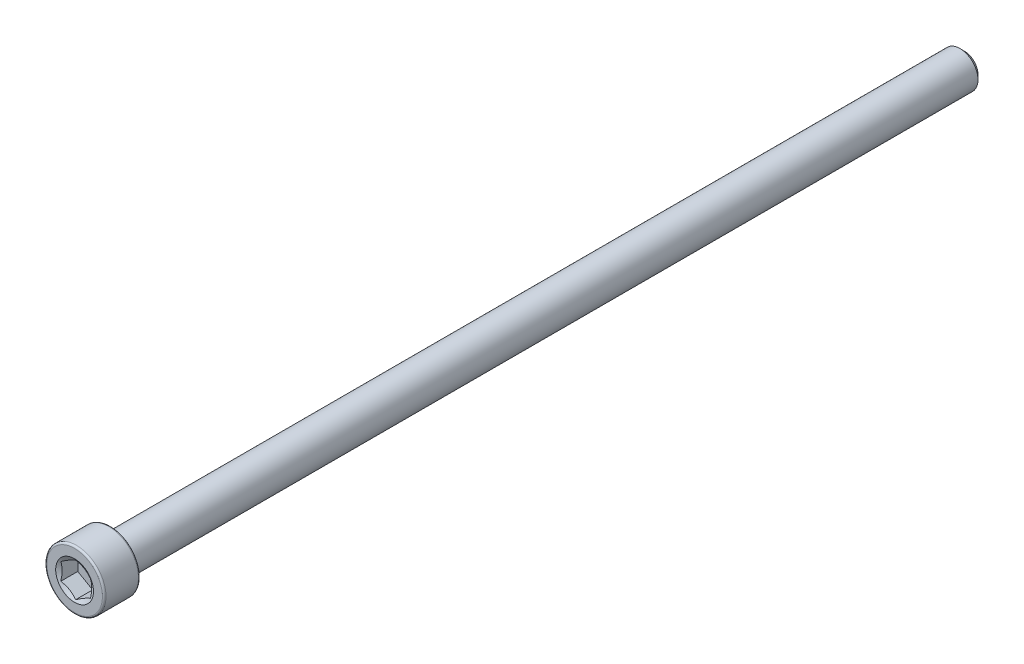
ISO-10303-21;
HEADER;
FILE_DESCRIPTION(('STEP AP214'),'2;1');
FILE_NAME('part.step','',(''),(''),'','','');
FILE_SCHEMA(('AUTOMOTIVE_DESIGN { 1 0 10303 214 1 1 1 1 }'));
ENDSEC;
DATA;
#1=APPLICATION_CONTEXT('core data for automotive mechanical design processes');
#2=APPLICATION_PROTOCOL_DEFINITION('international standard','automotive_design',2000,#1);
#3=PRODUCT_CONTEXT('',#1,'mechanical');
#4=PRODUCT('Part','Part','',(#3));
#5=PRODUCT_RELATED_PRODUCT_CATEGORY('part','',(#4));
#6=PRODUCT_DEFINITION_FORMATION('','',#4);
#7=PRODUCT_DEFINITION_CONTEXT('part definition',#1,'design');
#8=PRODUCT_DEFINITION('design','',#6,#7);
#9=PRODUCT_DEFINITION_SHAPE('','',#8);
#10=(LENGTH_UNIT() NAMED_UNIT(*) SI_UNIT(.MILLI.,.METRE.));
#11=(NAMED_UNIT(*) PLANE_ANGLE_UNIT() SI_UNIT($,.RADIAN.));
#12=(NAMED_UNIT(*) SI_UNIT($,.STERADIAN.) SOLID_ANGLE_UNIT());
#13=UNCERTAINTY_MEASURE_WITH_UNIT(LENGTH_MEASURE(1.E-05),#10,'distance_accuracy_value','');
#14=(GEOMETRIC_REPRESENTATION_CONTEXT(3) GLOBAL_UNCERTAINTY_ASSIGNED_CONTEXT((#13)) GLOBAL_UNIT_ASSIGNED_CONTEXT((#10,
#11,#12)) REPRESENTATION_CONTEXT('',''));
#15=CARTESIAN_POINT('',(0.,0.,0.));
#16=DIRECTION('',(0.,0.,1.));
#17=DIRECTION('',(1.,0.,0.));
#18=AXIS2_PLACEMENT_3D('',#15,#16,#17);
#19=CARTESIAN_POINT('',(0.,0.,-59.563));
#20=DIRECTION('',(0.,0.,-1.));
#21=DIRECTION('',(-1.,0.,0.));
#22=AXIS2_PLACEMENT_3D('',#19,#20,#21);
#23=PLANE('',#22);
#24=CARTESIAN_POINT('',(0.,0.,-59.563));
#25=DIRECTION('',(0.,0.,-1.));
#26=DIRECTION('',(-1.,0.,0.));
#27=AXIS2_PLACEMENT_3D('',#24,#25,#26);
#28=CIRCLE('',#27,1.81768750000003);
#29=CARTESIAN_POINT('',(-1.81768750000003,0.,-59.563));
#30=VERTEX_POINT('',#29);
#31=EDGE_CURVE('E52',#30,#30,#28,.T.);
#32=ORIENTED_EDGE('',*,*,#31,.T.);
#33=EDGE_LOOP('',(#32));
#34=FACE_BOUND('',#33,.T.);
#35=ADVANCED_FACE('F39',(#34),#23,.T.);
#36=CARTESIAN_POINT('',(0.,0.,-59.563));
#37=DIRECTION('',(0.,0.,1.));
#38=DIRECTION('',(1.,0.,0.));
#39=AXIS2_PLACEMENT_3D('',#36,#37,#38);
#40=CONICAL_SURFACE('',#39,1.81768750000003,0.785398163397443);
#41=CARTESIAN_POINT('',(0.,0.,-58.9676875));
#42=DIRECTION('',(0.,0.,-1.));
#43=DIRECTION('',(-1.,0.,0.));
#44=AXIS2_PLACEMENT_3D('',#41,#42,#43);
#45=CIRCLE('',#44,2.41300000000003);
#46=CARTESIAN_POINT('',(-2.41300000000003,0.,-58.9676875));
#47=VERTEX_POINT('',#46);
#48=EDGE_CURVE('E137',#47,#47,#45,.T.);
#49=ORIENTED_EDGE('',*,*,#48,.T.);
#50=EDGE_LOOP('',(#49));
#51=FACE_BOUND('',#50,.T.);
#52=ORIENTED_EDGE('',*,*,#31,.F.);
#53=EDGE_LOOP('',(#52));
#54=FACE_BOUND('',#53,.T.);
#55=ADVANCED_FACE('F143',(#51,#54),#40,.T.);
#56=CARTESIAN_POINT('',(0.,0.,-59.563));
#57=DIRECTION('',(0.,0.,-1.));
#58=DIRECTION('',(-1.,0.,0.));
#59=AXIS2_PLACEMENT_3D('',#56,#57,#58);
#60=CYLINDRICAL_SURFACE('',#59,2.41300000000002);
#61=CARTESIAN_POINT('',(0.,0.,54.737));
#62=DIRECTION('',(0.,0.,-1.));
#63=DIRECTION('',(-1.,0.,0.));
#64=AXIS2_PLACEMENT_3D('',#61,#62,#63);
#65=CIRCLE('',#64,2.41300000000001);
#66=CARTESIAN_POINT('',(-2.41300000000001,0.,54.737));
#67=VERTEX_POINT('',#66);
#68=EDGE_CURVE('E134',#67,#67,#65,.T.);
#69=ORIENTED_EDGE('',*,*,#68,.T.);
#70=EDGE_LOOP('',(#69));
#71=FACE_BOUND('',#70,.T.);
#72=ORIENTED_EDGE('',*,*,#48,.F.);
#73=EDGE_LOOP('',(#72));
#74=FACE_BOUND('',#73,.T.);
#75=ADVANCED_FACE('F145',(#71,#74),#60,.T.);
#76=CARTESIAN_POINT('',(0.,2.413,54.737));
#77=DIRECTION('',(0.,0.,-1.));
#78=DIRECTION('',(-1.,0.,0.));
#79=AXIS2_PLACEMENT_3D('',#76,#77,#78);
#80=PLANE('',#79);
#81=CARTESIAN_POINT('',(0.,0.,54.737));
#82=DIRECTION('',(0.,0.,-1.));
#83=DIRECTION('',(-1.,0.,0.));
#84=AXIS2_PLACEMENT_3D('',#81,#82,#83);
#85=CIRCLE('',#84,3.72745);
#86=CARTESIAN_POINT('',(-3.72745,0.,54.737));
#87=VERTEX_POINT('',#86);
#88=EDGE_CURVE('E131',#87,#87,#85,.T.);
#89=ORIENTED_EDGE('',*,*,#88,.T.);
#90=EDGE_LOOP('',(#89));
#91=FACE_BOUND('',#90,.T.);
#92=ORIENTED_EDGE('',*,*,#68,.F.);
#93=EDGE_LOOP('',(#92));
#94=FACE_BOUND('',#93,.T.);
#95=ADVANCED_FACE('F151',(#91,#94),#80,.T.);
#96=CARTESIAN_POINT('',(0.,0.,54.9783));
#97=DIRECTION('',(0.,0.,-1.));
#98=DIRECTION('',(-1.,0.,0.));
#99=AXIS2_PLACEMENT_3D('',#96,#97,#98);
#100=TOROIDAL_SURFACE('',#99,3.72745,0.241299999999999);
#101=CARTESIAN_POINT('',(0.,0.,54.9783));
#102=DIRECTION('',(0.,0.,-1.));
#103=DIRECTION('',(-1.,0.,0.));
#104=AXIS2_PLACEMENT_3D('',#101,#102,#103);
#105=CIRCLE('',#104,3.96875);
#106=CARTESIAN_POINT('',(-3.96875,0.,54.9783));
#107=VERTEX_POINT('',#106);
#108=EDGE_CURVE('E128',#107,#107,#105,.T.);
#109=ORIENTED_EDGE('',*,*,#108,.T.);
#110=EDGE_LOOP('',(#109));
#111=FACE_BOUND('',#110,.T.);
#112=ORIENTED_EDGE('',*,*,#88,.F.);
#113=EDGE_LOOP('',(#112));
#114=FACE_BOUND('',#113,.T.);
#115=ADVANCED_FACE('F157',(#111,#114),#100,.T.);
#116=CARTESIAN_POINT('',(0.,0.,-59.563));
#117=DIRECTION('',(0.,0.,-1.));
#118=DIRECTION('',(-1.,0.,0.));
#119=AXIS2_PLACEMENT_3D('',#116,#117,#118);
#120=CYLINDRICAL_SURFACE('',#119,3.96875);
#121=CARTESIAN_POINT('',(0.,0.,59.3217));
#122=DIRECTION('',(0.,0.,-1.));
#123=DIRECTION('',(-1.,0.,0.));
#124=AXIS2_PLACEMENT_3D('',#121,#122,#123);
#125=CIRCLE('',#124,3.96875);
#126=CARTESIAN_POINT('',(-3.96875,0.,59.3217));
#127=VERTEX_POINT('',#126);
#128=EDGE_CURVE('E125',#127,#127,#125,.T.);
#129=ORIENTED_EDGE('',*,*,#128,.T.);
#130=EDGE_LOOP('',(#129));
#131=FACE_BOUND('',#130,.T.);
#132=ORIENTED_EDGE('',*,*,#108,.F.);
#133=EDGE_LOOP('',(#132));
#134=FACE_BOUND('',#133,.T.);
#135=ADVANCED_FACE('F161',(#131,#134),#120,.T.);
#136=CARTESIAN_POINT('',(0.,0.,59.3217));
#137=DIRECTION('',(0.,0.,-1.));
#138=DIRECTION('',(-1.,0.,0.));
#139=AXIS2_PLACEMENT_3D('',#136,#137,#138);
#140=TOROIDAL_SURFACE('',#139,3.72745,0.2413);
#141=CARTESIAN_POINT('',(0.,0.,59.563));
#142=DIRECTION('',(0.,0.,-1.));
#143=DIRECTION('',(-1.,0.,0.));
#144=AXIS2_PLACEMENT_3D('',#141,#142,#143);
#145=CIRCLE('',#144,3.72745);
#146=CARTESIAN_POINT('',(-3.72745,0.,59.563));
#147=VERTEX_POINT('',#146);
#148=EDGE_CURVE('E122',#147,#147,#145,.T.);
#149=ORIENTED_EDGE('',*,*,#148,.T.);
#150=EDGE_LOOP('',(#149));
#151=FACE_BOUND('',#150,.T.);
#152=ORIENTED_EDGE('',*,*,#128,.F.);
#153=EDGE_LOOP('',(#152));
#154=FACE_BOUND('',#153,.T.);
#155=ADVANCED_FACE('F165',(#151,#154),#140,.T.);
#156=CARTESIAN_POINT('',(0.,3.72744999999998,59.563));
#157=DIRECTION('',(0.,0.,1.));
#158=DIRECTION('',(1.,0.,0.));
#159=AXIS2_PLACEMENT_3D('',#156,#157,#158);
#160=PLANE('',#159);
#161=CARTESIAN_POINT('',(0.,0.,59.563));
#162=DIRECTION('',(0.,0.,1.));
#163=DIRECTION('',(1.,0.,0.));
#164=AXIS2_PLACEMENT_3D('',#161,#162,#163);
#165=CIRCLE('',#164,2.53070740070525);
#166=CARTESIAN_POINT('',(2.53070740070525,0.,59.563));
#167=VERTEX_POINT('',#166);
#168=EDGE_CURVE('E259',#167,#167,#165,.T.);
#169=ORIENTED_EDGE('',*,*,#168,.F.);
#170=EDGE_LOOP('',(#169));
#171=FACE_BOUND('',#170,.T.);
#172=ORIENTED_EDGE('',*,*,#148,.F.);
#173=EDGE_LOOP('',(#172));
#174=FACE_BOUND('',#173,.T.);
#175=ADVANCED_FACE('F169',(#171,#174),#160,.T.);
#176=CARTESIAN_POINT('',(0.,0.,59.563));
#177=DIRECTION('',(0.,0.,1.));
#178=DIRECTION('',(1.,0.,0.));
#179=AXIS2_PLACEMENT_3D('',#176,#177,#178);
#180=CONICAL_SURFACE('',#179,2.53070740070525,1.0471975511966);
#181=ORIENTED_EDGE('',*,*,#168,.T.);
#182=EDGE_LOOP('',(#181));
#183=FACE_BOUND('',#182,.T.);
#184=CARTESIAN_POINT('',(1.98457499999998,1.14556397036931,59.4248787393351));
#185=CARTESIAN_POINT('',(1.89737036121931,1.19591159204392,59.3957977498695));
#186=CARTESIAN_POINT('',(1.80941298069499,1.24669380936685,59.3693492756564));
#187=CARTESIAN_POINT('',(1.63197502132767,1.34913766297203,59.3231823388358));
#188=CARTESIAN_POINT('',(1.54249128874367,1.4008011200675,59.3034802098783));
#189=CARTESIAN_POINT('',(1.36463285198752,1.50348773640631,59.2728097995608));
#190=CARTESIAN_POINT('',(1.2762855196939,1.55449509248821,59.2616374103495));
#191=CARTESIAN_POINT('',(1.09917497188904,1.65674991493967,59.2482978636837));
#192=CARTESIAN_POINT('',(1.01041240048945,1.70799700943119,59.2461196620894));
#193=CARTESIAN_POINT('',(0.844542697135332,1.80376192731309,59.2506416191377));
#194=CARTESIAN_POINT('',(0.767410784334087,1.848294057932,59.2562314810852));
#195=CARTESIAN_POINT('',(0.613649492810914,1.93706818098385,59.2739510015263));
#196=CARTESIAN_POINT('',(0.537020646254471,1.9813098661709,59.2860867179588));
#197=CARTESIAN_POINT('',(0.382942111493213,2.07026714969166,59.3164262264737));
#198=CARTESIAN_POINT('',(0.305511932787314,2.11497148421091,59.3347586769203));
#199=CARTESIAN_POINT('',(0.151806688756409,2.20371324822801,59.3763665740295));
#200=CARTESIAN_POINT('',(0.0755296529470657,2.24775181538552,59.3996322389117));
#201=CARTESIAN_POINT('',(-0.000200000000002008,2.29147435090015,59.4248787393351));
#202=B_SPLINE_CURVE_WITH_KNOTS('',3,(#184,#185,#186,#187,#188,#189,#190,#191,#192,#193,#194,
#195,#196,#197,#198,#199,#200,#201),.UNSPECIFIED.,.F.,.F.,(4,2,2,2,2,2,2,2,4),(0.,
0.314555137114082,0.6298665496688,0.937373439505925,1.24450262309397,1.51196650590477,
1.77967834211413,2.05332989762153,2.32644383656791),.UNSPECIFIED.);
#203=CARTESIAN_POINT('',(1.98437499999998,1.14567944042315,59.4248120676293));
#204=VERTEX_POINT('',#203);
#205=CARTESIAN_POINT('',(0.,2.29135888084631,59.4248120676293));
#206=VERTEX_POINT('',#205);
#207=EDGE_CURVE('E106',#204,#206,#202,.T.);
#208=ORIENTED_EDGE('',*,*,#207,.F.);
#209=CARTESIAN_POINT('',(1.98437499999998,-3.00026729742339,60.1786996764954));
#210=CARTESIAN_POINT('',(1.98437499999998,-2.91417852714617,60.1372554995199));
#211=CARTESIAN_POINT('',(1.98437499999998,-2.82788354366182,60.0962318701391));
#212=CARTESIAN_POINT('',(1.98437499999998,-2.65477109089712,60.0152640719882));
#213=CARTESIAN_POINT('',(1.98437499999998,-2.56795353399494,59.9753200907809));
#214=CARTESIAN_POINT('',(1.98437499999998,-2.39320060303682,59.8965322756389));
#215=CARTESIAN_POINT('',(1.98437499999998,-2.30526165499614,59.8576963397322));
#216=CARTESIAN_POINT('',(1.98437499999998,-2.12865626167958,59.7817217534969));
#217=CARTESIAN_POINT('',(1.98437499999998,-2.0399898536152,59.7445830169827));
#218=CARTESIAN_POINT('',(1.98437499999998,-1.85931319770472,59.6714519444036));
#219=CARTESIAN_POINT('',(1.98437499999998,-1.76727839255488,59.6355199296325));
#220=CARTESIAN_POINT('',(1.98437499999998,-1.58210416266519,59.5665670586381));
#221=CARTESIAN_POINT('',(1.98437499999998,-1.48896461158262,59.5335465390977));
#222=CARTESIAN_POINT('',(1.98437499999998,-1.30163731722862,59.4713414082388));
#223=CARTESIAN_POINT('',(1.98437499999998,-1.20745247053434,59.442148166413));
#224=CARTESIAN_POINT('',(1.98437499999998,-1.0177273513406,59.3885801299636));
#225=CARTESIAN_POINT('',(1.98437499999998,-0.922187418803863,59.3642041489301));
#226=CARTESIAN_POINT('',(1.98437499999998,-0.730187774437195,59.3216100252547));
#227=CARTESIAN_POINT('',(1.98437499999998,-0.633734462555379,59.3033635885809));
#228=CARTESIAN_POINT('',(1.98437499999998,-0.439715276353551,59.2741213033277));
#229=CARTESIAN_POINT('',(1.98437499999998,-0.342149489314399,59.263124889865));
#230=CARTESIAN_POINT('',(1.98437499999998,-0.147628044199056,59.2494070417718));
#231=CARTESIAN_POINT('',(1.98437499999998,-0.0506796597421236,59.2465854104354));
#232=CARTESIAN_POINT('',(1.98437499999998,0.143103115571662,59.249185514727));
#233=CARTESIAN_POINT('',(1.98437499999998,0.239937499827362,59.2546077062766));
#234=CARTESIAN_POINT('',(1.98437499999998,0.476970423936255,59.2774923549886));
#235=CARTESIAN_POINT('',(1.98437499999998,0.616748292390843,59.2993270404436));
#236=CARTESIAN_POINT('',(1.98437499999998,0.893607928884514,59.3561402077941));
#237=CARTESIAN_POINT('',(1.98437499999998,1.030686768829,59.3911322170173));
#238=CARTESIAN_POINT('',(1.98437499999998,1.30511969999723,59.4714152230234));
#239=CARTESIAN_POINT('',(1.98437499999998,1.44240893450286,59.5169226619543));
#240=CARTESIAN_POINT('',(1.98437499999998,1.64644508842433,59.5902634246735));
#241=CARTESIAN_POINT('',(1.98437499999998,1.71413212999321,59.6155533074583));
#242=CARTESIAN_POINT('',(1.98437499999998,1.84895802350132,59.6675549515399));
#243=CARTESIAN_POINT('',(1.98437499999998,1.91609688529705,59.6942666872059));
#244=CARTESIAN_POINT('',(1.98437499999998,2.09043183263474,59.7654120267758));
#245=CARTESIAN_POINT('',(1.98437499999998,2.19724734382523,59.8107757687467));
#246=CARTESIAN_POINT('',(1.98437499999998,2.40988153193629,59.9037895460846));
#247=CARTESIAN_POINT('',(1.98437499999998,2.5157001286056,59.9514397636623));
#248=CARTESIAN_POINT('',(1.98437499999998,2.72655852247189,60.0485005052356));
#249=CARTESIAN_POINT('',(1.98437499999998,2.83159810540153,60.0979114933103));
#250=CARTESIAN_POINT('',(1.98437499999998,3.04102680140025,60.1980954913632));
#251=CARTESIAN_POINT('',(1.98437499999998,3.14541589892037,60.2488685337466));
#252=CARTESIAN_POINT('',(1.98437499999998,3.45805934392728,60.4029112385608));
#253=CARTESIAN_POINT('',(1.98437499999998,3.66552471194403,60.5077805102459));
#254=CARTESIAN_POINT('',(1.98437499999998,4.07900502507438,60.7202421528608));
#255=CARTESIAN_POINT('',(1.98437499999998,4.28502019488323,60.8278340895145));
#256=CARTESIAN_POINT('',(1.98437499999998,4.67597606585553,61.0342945522279));
#257=CARTESIAN_POINT('',(1.98437499999998,4.8610092056076,61.1329883192138));
#258=CARTESIAN_POINT('',(1.98437499999998,5.23047989061983,61.331503421698));
#259=CARTESIAN_POINT('',(1.98437499999998,5.41491740749765,61.4313248099387));
#260=CARTESIAN_POINT('',(1.98437499999998,5.78283314119706,61.6315376967861));
#261=CARTESIAN_POINT('',(1.98437499999998,5.96631260293179,61.7319269102676));
#262=CARTESIAN_POINT('',(1.98437499999998,6.33289930192253,61.9333559236772));
#263=CARTESIAN_POINT('',(1.98437499999998,6.51600656168198,62.0343956826348));
#264=CARTESIAN_POINT('',(1.98437499999998,6.69898126466817,62.1356733706002));
#265=B_SPLINE_CURVE_WITH_KNOTS('',3,(#209,#210,#211,#212,#213,#214,#215,#216,#217,#218,#219,
#220,#221,#222,#223,#224,#225,#226,#227,#228,#229,#230,#231,#232,#233,#234,#235,#236,#237,#238,
#239,#240,#241,#242,#243,#244,#245,#246,#247,#248,#249,#250,#251,#252,#253,#254,#255,#256,#257,
#258,#259,#260,#261,#262,#263,#264),.UNSPECIFIED.,.F.,.F.,(4,2,2,2,2,2,2,2,2,2,2,2,2,2,2,2,2,2,
2,2,2,2,2,2,2,2,2,4),(0.,0.286639682230862,0.573328845206275,0.861712521680992,1.1500815374161,
1.44644465754249,1.74284200403622,2.03855903673007,2.33420314830459,2.62846318470744,
2.92270029122631,3.21331540991077,3.50394660154195,3.92748841830869,4.35146688350433,
4.78510306957838,5.00186448248398,5.21862198930867,5.56673163285502,5.91486906368416,
6.26309894038445,6.61133710935788,7.30869129939498,8.0059349511209,8.63505562775265,
9.2642058532201,9.8916471044579,10.5190492194133),.UNSPECIFIED.);
#266=CARTESIAN_POINT('',(1.98437499999998,-1.14567944042315,59.4248120676293));
#267=VERTEX_POINT('',#266);
#268=EDGE_CURVE('E215',#267,#204,#265,.T.);
#269=ORIENTED_EDGE('',*,*,#268,.F.);
#270=CARTESIAN_POINT('',(-0.000200000000001244,-2.29147435090015,59.4248787393351));
#271=CARTESIAN_POINT('',(0.0870046387806751,-2.24112672922554,59.3957977498695));
#272=CARTESIAN_POINT('',(0.174962019304995,-2.19034451190261,59.3693492756564));
#273=CARTESIAN_POINT('',(0.352399978672317,-2.08790065829743,59.3231823388358));
#274=CARTESIAN_POINT('',(0.441883711256315,-2.03623720120196,59.3034802098783));
#275=CARTESIAN_POINT('',(0.619742148012463,-1.93355058486316,59.2728097995608));
#276=CARTESIAN_POINT('',(0.708089480306087,-1.88254322878125,59.2616374103495));
#277=CARTESIAN_POINT('',(0.885200028110941,-1.78028840632979,59.2482978636837));
#278=CARTESIAN_POINT('',(0.973962599510538,-1.72904131183827,59.2461196620894));
#279=CARTESIAN_POINT('',(1.13983230286465,-1.63327639395637,59.2506416191377));
#280=CARTESIAN_POINT('',(1.2169642156659,-1.58874426333746,59.2562314810852));
#281=CARTESIAN_POINT('',(1.37072550718907,-1.49997014028561,59.2739510015263));
#282=CARTESIAN_POINT('',(1.44735435374551,-1.45572845509856,59.2860867179588));
#283=CARTESIAN_POINT('',(1.60143288850677,-1.36677117157781,59.3164262264737));
#284=CARTESIAN_POINT('',(1.67886306721267,-1.32206683705855,59.3347586769203));
#285=CARTESIAN_POINT('',(1.83256831124357,-1.23332507304145,59.3763665740295));
#286=CARTESIAN_POINT('',(1.90884534705292,-1.18928650588394,59.3996322389117));
#287=CARTESIAN_POINT('',(1.98457499999998,-1.14556397036932,59.4248787393351));
#288=B_SPLINE_CURVE_WITH_KNOTS('',3,(#270,#271,#272,#273,#274,#275,#276,#277,#278,#279,#280,
#281,#282,#283,#284,#285,#286,#287),.UNSPECIFIED.,.F.,.F.,(4,2,2,2,2,2,2,2,4),(0.,
0.314555137114083,0.629866549668801,0.937373439505925,1.24450262309397,1.51196650590477,
1.77967834211413,2.05332989762153,2.32644383656791),.UNSPECIFIED.);
#289=CARTESIAN_POINT('',(0.,-2.29135888084631,59.4248120676293));
#290=VERTEX_POINT('',#289);
#291=EDGE_CURVE('E209',#290,#267,#288,.T.);
#292=ORIENTED_EDGE('',*,*,#291,.F.);
#293=CARTESIAN_POINT('',(-1.98457499999998,-1.14556397036932,59.4248787393351));
#294=CARTESIAN_POINT('',(-1.89737036121931,-1.19591159204392,59.3957977498695));
#295=CARTESIAN_POINT('',(-1.80941298069499,-1.24669380936686,59.3693492756564));
#296=CARTESIAN_POINT('',(-1.63197502132767,-1.34913766297204,59.3231823388358));
#297=CARTESIAN_POINT('',(-1.54249128874367,-1.4008011200675,59.3034802098783));
#298=CARTESIAN_POINT('',(-1.36463285198752,-1.50348773640631,59.2728097995608));
#299=CARTESIAN_POINT('',(-1.2762855196939,-1.55449509248822,59.2616374103495));
#300=CARTESIAN_POINT('',(-1.09917497188904,-1.65674991493967,59.2482978636837));
#301=CARTESIAN_POINT('',(-1.01041240048945,-1.70799700943119,59.2461196620894));
#302=CARTESIAN_POINT('',(-0.844542697135334,-1.80376192731309,59.2506416191377));
#303=CARTESIAN_POINT('',(-0.767410784334089,-1.848294057932,59.2562314810852));
#304=CARTESIAN_POINT('',(-0.613649492810916,-1.93706818098385,59.2739510015263));
#305=CARTESIAN_POINT('',(-0.537020646254473,-1.9813098661709,59.2860867179588));
#306=CARTESIAN_POINT('',(-0.382942111493216,-2.07026714969166,59.3164262264737));
#307=CARTESIAN_POINT('',(-0.305511932787317,-2.11497148421091,59.3347586769203));
#308=CARTESIAN_POINT('',(-0.151806688756413,-2.20371324822801,59.3763665740295));
#309=CARTESIAN_POINT('',(-0.0755296529470697,-2.24775181538552,59.3996322389117));
#310=CARTESIAN_POINT('',(0.000199999999998356,-2.29147435090015,59.4248787393351));
#311=B_SPLINE_CURVE_WITH_KNOTS('',3,(#293,#294,#295,#296,#297,#298,#299,#300,#301,#302,#303,
#304,#305,#306,#307,#308,#309,#310),.UNSPECIFIED.,.F.,.F.,(4,2,2,2,2,2,2,2,4),(0.,
0.314555137114083,0.6298665496688,0.937373439505924,1.24450262309397,1.51196650590476,
1.77967834211413,2.05332989762153,2.32644383656791),.UNSPECIFIED.);
#312=CARTESIAN_POINT('',(-1.98437499999998,-1.14567944042316,59.4248120676293));
#313=VERTEX_POINT('',#312);
#314=EDGE_CURVE('E59',#313,#290,#311,.T.);
#315=ORIENTED_EDGE('',*,*,#314,.F.);
#316=CARTESIAN_POINT('',(-1.98437499999998,-3.00026729742339,60.1786996764954));
#317=CARTESIAN_POINT('',(-1.98437499999998,-2.91417852714617,60.1372554995199));
#318=CARTESIAN_POINT('',(-1.98437499999998,-2.82788354366182,60.0962318701391));
#319=CARTESIAN_POINT('',(-1.98437499999998,-2.65477109089712,60.0152640719882));
#320=CARTESIAN_POINT('',(-1.98437499999998,-2.56795353399494,59.9753200907809));
#321=CARTESIAN_POINT('',(-1.98437499999998,-2.39320060303682,59.8965322756389));
#322=CARTESIAN_POINT('',(-1.98437499999998,-2.30526165499614,59.8576963397322));
#323=CARTESIAN_POINT('',(-1.98437499999998,-2.12865626167958,59.7817217534969));
#324=CARTESIAN_POINT('',(-1.98437499999998,-2.03998985361519,59.7445830169827));
#325=CARTESIAN_POINT('',(-1.98437499999998,-1.85931319770472,59.6714519444036));
#326=CARTESIAN_POINT('',(-1.98437499999998,-1.76727839255488,59.6355199296325));
#327=CARTESIAN_POINT('',(-1.98437499999998,-1.58210416266519,59.5665670586381));
#328=CARTESIAN_POINT('',(-1.98437499999998,-1.48896461158262,59.5335465390977));
#329=CARTESIAN_POINT('',(-1.98437499999998,-1.30163731722862,59.4713414082388));
#330=CARTESIAN_POINT('',(-1.98437499999998,-1.20745247053434,59.442148166413));
#331=CARTESIAN_POINT('',(-1.98437499999998,-1.0177273513406,59.3885801299636));
#332=CARTESIAN_POINT('',(-1.98437499999998,-0.922187418803862,59.3642041489301));
#333=CARTESIAN_POINT('',(-1.98437499999998,-0.730187774437194,59.3216100252547));
#334=CARTESIAN_POINT('',(-1.98437499999998,-0.633734462555377,59.3033635885809));
#335=CARTESIAN_POINT('',(-1.98437499999998,-0.439715276353549,59.2741213033277));
#336=CARTESIAN_POINT('',(-1.98437499999998,-0.342149489314397,59.263124889865));
#337=CARTESIAN_POINT('',(-1.98437499999998,-0.147628044199054,59.2494070417718));
#338=CARTESIAN_POINT('',(-1.98437499999998,-0.0506796597421216,59.2465854104354));
#339=CARTESIAN_POINT('',(-1.98437499999998,0.143103115571663,59.249185514727));
#340=CARTESIAN_POINT('',(-1.98437499999998,0.239937499827364,59.2546077062766));
#341=CARTESIAN_POINT('',(-1.98437499999998,0.476970423936256,59.2774923549886));
#342=CARTESIAN_POINT('',(-1.98437499999998,0.616748292390844,59.2993270404436));
#343=CARTESIAN_POINT('',(-1.98437499999998,0.893607928884514,59.3561402077941));
#344=CARTESIAN_POINT('',(-1.98437499999998,1.030686768829,59.3911322170173));
#345=CARTESIAN_POINT('',(-1.98437499999998,1.30511969999723,59.4714152230234));
#346=CARTESIAN_POINT('',(-1.98437499999998,1.44240893450286,59.5169226619543));
#347=CARTESIAN_POINT('',(-1.98437499999998,1.64644508842433,59.5902634246735));
#348=CARTESIAN_POINT('',(-1.98437499999998,1.71413212999321,59.6155533074583));
#349=CARTESIAN_POINT('',(-1.98437499999998,1.84895802350132,59.6675549515399));
#350=CARTESIAN_POINT('',(-1.98437499999998,1.91609688529705,59.6942666872059));
#351=CARTESIAN_POINT('',(-1.98437499999998,2.09043183263474,59.7654120267758));
#352=CARTESIAN_POINT('',(-1.98437499999998,2.19724734382523,59.8107757687467));
#353=CARTESIAN_POINT('',(-1.98437499999998,2.4098815319363,59.9037895460846));
#354=CARTESIAN_POINT('',(-1.98437499999998,2.51570012860561,59.9514397636623));
#355=CARTESIAN_POINT('',(-1.98437499999998,2.72655852247189,60.0485005052356));
#356=CARTESIAN_POINT('',(-1.98437499999998,2.83159810540153,60.0979114933103));
#357=CARTESIAN_POINT('',(-1.98437499999998,3.04102680140026,60.1980954913632));
#358=CARTESIAN_POINT('',(-1.98437499999998,3.14541589892037,60.2488685337466));
#359=CARTESIAN_POINT('',(-1.98437499999998,3.45805934392728,60.4029112385608));
#360=CARTESIAN_POINT('',(-1.98437499999998,3.66552471194404,60.5077805102459));
#361=CARTESIAN_POINT('',(-1.98437499999998,4.07900502507439,60.7202421528608));
#362=CARTESIAN_POINT('',(-1.98437499999998,4.28502019488325,60.8278340895145));
#363=CARTESIAN_POINT('',(-1.98437499999998,4.67597606585554,61.0342945522279));
#364=CARTESIAN_POINT('',(-1.98437499999998,4.86100920560761,61.1329883192138));
#365=CARTESIAN_POINT('',(-1.98437499999998,5.23047989061984,61.331503421698));
#366=CARTESIAN_POINT('',(-1.98437499999998,5.41491740749766,61.4313248099387));
#367=CARTESIAN_POINT('',(-1.98437499999998,5.78283314119707,61.6315376967861));
#368=CARTESIAN_POINT('',(-1.98437499999998,5.9663126029318,61.7319269102676));
#369=CARTESIAN_POINT('',(-1.98437499999998,6.33289930192253,61.9333559236772));
#370=CARTESIAN_POINT('',(-1.98437499999998,6.51600656168198,62.0343956826348));
#371=CARTESIAN_POINT('',(-1.98437499999998,6.69898126466817,62.1356733706002));
#372=B_SPLINE_CURVE_WITH_KNOTS('',3,(#316,#317,#318,#319,#320,#321,#322,#323,#324,#325,#326,
#327,#328,#329,#330,#331,#332,#333,#334,#335,#336,#337,#338,#339,#340,#341,#342,#343,#344,#345,
#346,#347,#348,#349,#350,#351,#352,#353,#354,#355,#356,#357,#358,#359,#360,#361,#362,#363,#364,
#365,#366,#367,#368,#369,#370,#371),.UNSPECIFIED.,.F.,.F.,(4,2,2,2,2,2,2,2,2,2,2,2,2,2,2,2,2,2,
2,2,2,2,2,2,2,2,2,4),(0.,0.286639682230862,0.573328845206275,0.861712521680992,1.1500815374161,
1.44644465754249,1.74284200403622,2.03855903673007,2.33420314830459,2.62846318470744,
2.92270029122631,3.21331540991077,3.50394660154195,3.92748841830869,4.35146688350433,
4.78510306957838,5.00186448248398,5.21862198930867,5.56673163285503,5.91486906368416,
6.26309894038445,6.61133710935788,7.30869129939498,8.00593495112091,8.63505562775266,
9.26420585322011,9.8916471044579,10.5190492194133),.UNSPECIFIED.);
#373=CARTESIAN_POINT('',(-1.98437499999998,1.14567944042315,59.4248120676293));
#374=VERTEX_POINT('',#373);
#375=EDGE_CURVE('E11',#374,#313,#372,.F.);
#376=ORIENTED_EDGE('',*,*,#375,.F.);
#377=CARTESIAN_POINT('',(0.000199999999997468,2.29147435090015,59.4248787393351));
#378=CARTESIAN_POINT('',(-0.0870046387806788,2.24112672922554,59.3957977498695));
#379=CARTESIAN_POINT('',(-0.174962019304998,2.19034451190261,59.3693492756564));
#380=CARTESIAN_POINT('',(-0.35239997867232,2.08790065829743,59.3231823388358));
#381=CARTESIAN_POINT('',(-0.441883711256318,2.03623720120196,59.3034802098783));
#382=CARTESIAN_POINT('',(-0.619742148012465,1.93355058486316,59.2728097995608));
#383=CARTESIAN_POINT('',(-0.708089480306089,1.88254322878125,59.2616374103495));
#384=CARTESIAN_POINT('',(-0.885200028110944,1.78028840632979,59.2482978636837));
#385=CARTESIAN_POINT('',(-0.97396259951054,1.72904131183827,59.2461196620894));
#386=CARTESIAN_POINT('',(-1.13983230286465,1.63327639395637,59.2506416191377));
#387=CARTESIAN_POINT('',(-1.2169642156659,1.58874426333746,59.2562314810852));
#388=CARTESIAN_POINT('',(-1.37072550718907,1.49997014028561,59.2739510015263));
#389=CARTESIAN_POINT('',(-1.44735435374551,1.45572845509856,59.2860867179588));
#390=CARTESIAN_POINT('',(-1.60143288850677,1.36677117157781,59.3164262264737));
#391=CARTESIAN_POINT('',(-1.67886306721267,1.32206683705855,59.3347586769203));
#392=CARTESIAN_POINT('',(-1.83256831124357,1.23332507304145,59.3763665740295));
#393=CARTESIAN_POINT('',(-1.90884534705292,1.18928650588394,59.3996322389117));
#394=CARTESIAN_POINT('',(-1.98457499999998,1.14556397036932,59.4248787393351));
#395=B_SPLINE_CURVE_WITH_KNOTS('',3,(#377,#378,#379,#380,#381,#382,#383,#384,#385,#386,#387,
#388,#389,#390,#391,#392,#393,#394),.UNSPECIFIED.,.F.,.F.,(4,2,2,2,2,2,2,2,4),(0.,
0.314555137114083,0.6298665496688,0.937373439505925,1.24450262309397,1.51196650590476,
1.77967834211413,2.05332989762153,2.32644383656791),.UNSPECIFIED.);
#396=EDGE_CURVE('E97',#206,#374,#395,.T.);
#397=ORIENTED_EDGE('',*,*,#396,.F.);
#398=EDGE_LOOP('',(#208,#269,#292,#315,#376,#397));
#399=FACE_BOUND('',#398,.T.);
#400=ADVANCED_FACE('F96',(#183,#399),#180,.F.);
#401=CARTESIAN_POINT('',(0.,0.,57.15));
#402=DIRECTION('',(0.,0.,1.));
#403=DIRECTION('',(1.,0.,0.));
#404=AXIS2_PLACEMENT_3D('',#401,#402,#403);
#405=PLANE('',#404);
#406=DIRECTION('',(-0.866025403784438,-0.5,0.));
#407=VECTOR('',#406,1.);
#408=CARTESIAN_POINT('',(0.,2.29135888084631,57.15));
#409=LINE('',#408,#407);
#410=CARTESIAN_POINT('',(0.,2.29135888084631,57.15));
#411=VERTEX_POINT('',#410);
#412=CARTESIAN_POINT('',(-1.98437499999998,1.14567944042315,57.15));
#413=VERTEX_POINT('',#412);
#414=EDGE_CURVE('E105',#411,#413,#409,.T.);
#415=ORIENTED_EDGE('',*,*,#414,.T.);
#416=DIRECTION('',(0.,-1.,0.));
#417=VECTOR('',#416,1.);
#418=CARTESIAN_POINT('',(-1.98437499999998,1.14567944042315,57.15));
#419=LINE('',#418,#417);
#420=CARTESIAN_POINT('',(-1.98437499999998,-1.14567944042316,57.15));
#421=VERTEX_POINT('',#420);
#422=EDGE_CURVE('E110',#413,#421,#419,.T.);
#423=ORIENTED_EDGE('',*,*,#422,.T.);
#424=DIRECTION('',(0.866025403784439,-0.5,0.));
#425=VECTOR('',#424,1.);
#426=CARTESIAN_POINT('',(-1.98437499999998,-1.14567944042316,57.15));
#427=LINE('',#426,#425);
#428=CARTESIAN_POINT('',(0.,-2.29135888084631,57.15));
#429=VERTEX_POINT('',#428);
#430=EDGE_CURVE('E241',#421,#429,#427,.T.);
#431=ORIENTED_EDGE('',*,*,#430,.T.);
#432=DIRECTION('',(0.866025403784439,0.5,0.));
#433=VECTOR('',#432,1.);
#434=CARTESIAN_POINT('',(0.,-2.29135888084631,57.15));
#435=LINE('',#434,#433);
#436=CARTESIAN_POINT('',(1.98437499999998,-1.14567944042315,57.15));
#437=VERTEX_POINT('',#436);
#438=EDGE_CURVE('E245',#429,#437,#435,.T.);
#439=ORIENTED_EDGE('',*,*,#438,.T.);
#440=DIRECTION('',(0.,1.,0.));
#441=VECTOR('',#440,1.);
#442=CARTESIAN_POINT('',(1.98437499999998,-1.14567944042315,57.15));
#443=LINE('',#442,#441);
#444=CARTESIAN_POINT('',(1.98437499999998,1.14567944042315,57.15));
#445=VERTEX_POINT('',#444);
#446=EDGE_CURVE('E118',#437,#445,#443,.T.);
#447=ORIENTED_EDGE('',*,*,#446,.T.);
#448=DIRECTION('',(-0.866025403784439,0.5,0.));
#449=VECTOR('',#448,1.);
#450=CARTESIAN_POINT('',(1.98437499999998,1.14567944042315,57.15));
#451=LINE('',#450,#449);
#452=EDGE_CURVE('E113',#445,#411,#451,.T.);
#453=ORIENTED_EDGE('',*,*,#452,.T.);
#454=EDGE_LOOP('',(#415,#423,#431,#439,#447,#453));
#455=FACE_BOUND('',#454,.T.);
#456=ADVANCED_FACE('F195',(#455),#405,.T.);
#457=CARTESIAN_POINT('',(-1.98437499999998,1.14567944042315,57.15));
#458=DIRECTION('',(-1.,0.,0.));
#459=DIRECTION('',(0.,0.,1.));
#460=AXIS2_PLACEMENT_3D('',#457,#458,#459);
#461=PLANE('',#460);
#462=DIRECTION('',(0.,0.,1.));
#463=VECTOR('',#462,1.);
#464=CARTESIAN_POINT('',(-1.98437499999998,1.14567944042315,57.15));
#465=LINE('',#464,#463);
#466=EDGE_CURVE('E103',#413,#374,#465,.T.);
#467=ORIENTED_EDGE('',*,*,#466,.T.);
#468=ORIENTED_EDGE('',*,*,#375,.T.);
#469=DIRECTION('',(0.,0.,1.));
#470=VECTOR('',#469,1.);
#471=CARTESIAN_POINT('',(-1.98437499999998,-1.14567944042316,57.15));
#472=LINE('',#471,#470);
#473=EDGE_CURVE('E112',#421,#313,#472,.T.);
#474=ORIENTED_EDGE('',*,*,#473,.F.);
#475=ORIENTED_EDGE('',*,*,#422,.F.);
#476=EDGE_LOOP('',(#467,#468,#474,#475));
#477=FACE_BOUND('',#476,.T.);
#478=ADVANCED_FACE('F108',(#477),#461,.F.);
#479=CARTESIAN_POINT('',(-1.98437499999998,-1.14567944042316,57.15));
#480=DIRECTION('',(-0.5,-0.866025403784439,0.));
#481=DIRECTION('',(0.866025403784439,-0.5,0.));
#482=AXIS2_PLACEMENT_3D('',#479,#480,#481);
#483=PLANE('',#482);
#484=ORIENTED_EDGE('',*,*,#473,.T.);
#485=ORIENTED_EDGE('',*,*,#314,.T.);
#486=DIRECTION('',(0.,0.,1.));
#487=VECTOR('',#486,1.);
#488=CARTESIAN_POINT('',(0.,-2.29135888084631,57.15));
#489=LINE('',#488,#487);
#490=EDGE_CURVE('E115',#429,#290,#489,.T.);
#491=ORIENTED_EDGE('',*,*,#490,.F.);
#492=ORIENTED_EDGE('',*,*,#430,.F.);
#493=EDGE_LOOP('',(#484,#485,#491,#492));
#494=FACE_BOUND('',#493,.T.);
#495=ADVANCED_FACE('F230',(#494),#483,.F.);
#496=CARTESIAN_POINT('',(0.,-2.29135888084631,57.15));
#497=DIRECTION('',(0.5,-0.866025403784439,0.));
#498=DIRECTION('',(0.866025403784439,0.5,0.));
#499=AXIS2_PLACEMENT_3D('',#496,#497,#498);
#500=PLANE('',#499);
#501=ORIENTED_EDGE('',*,*,#490,.T.);
#502=ORIENTED_EDGE('',*,*,#291,.T.);
#503=DIRECTION('',(0.,0.,1.));
#504=VECTOR('',#503,1.);
#505=CARTESIAN_POINT('',(1.98437499999998,-1.14567944042315,57.15));
#506=LINE('',#505,#504);
#507=EDGE_CURVE('E255',#437,#267,#506,.T.);
#508=ORIENTED_EDGE('',*,*,#507,.F.);
#509=ORIENTED_EDGE('',*,*,#438,.F.);
#510=EDGE_LOOP('',(#501,#502,#508,#509));
#511=FACE_BOUND('',#510,.T.);
#512=ADVANCED_FACE('F225',(#511),#500,.F.);
#513=CARTESIAN_POINT('',(1.98437499999998,-1.14567944042315,57.15));
#514=DIRECTION('',(1.,0.,0.));
#515=DIRECTION('',(0.,0.,-1.));
#516=AXIS2_PLACEMENT_3D('',#513,#514,#515);
#517=PLANE('',#516);
#518=ORIENTED_EDGE('',*,*,#507,.T.);
#519=ORIENTED_EDGE('',*,*,#268,.T.);
#520=DIRECTION('',(0.,0.,1.));
#521=VECTOR('',#520,1.);
#522=CARTESIAN_POINT('',(1.98437499999998,1.14567944042315,57.15));
#523=LINE('',#522,#521);
#524=EDGE_CURVE('E252',#445,#204,#523,.T.);
#525=ORIENTED_EDGE('',*,*,#524,.F.);
#526=ORIENTED_EDGE('',*,*,#446,.F.);
#527=EDGE_LOOP('',(#518,#519,#525,#526));
#528=FACE_BOUND('',#527,.T.);
#529=ADVANCED_FACE('F222',(#528),#517,.F.);
#530=CARTESIAN_POINT('',(1.98437499999998,1.14567944042315,57.15));
#531=DIRECTION('',(0.5,0.866025403784439,0.));
#532=DIRECTION('',(-0.866025403784439,0.5,0.));
#533=AXIS2_PLACEMENT_3D('',#530,#531,#532);
#534=PLANE('',#533);
#535=ORIENTED_EDGE('',*,*,#524,.T.);
#536=ORIENTED_EDGE('',*,*,#207,.T.);
#537=DIRECTION('',(0.,0.,1.));
#538=VECTOR('',#537,1.);
#539=CARTESIAN_POINT('',(0.,2.29135888084631,57.15));
#540=LINE('',#539,#538);
#541=EDGE_CURVE('E66',#411,#206,#540,.T.);
#542=ORIENTED_EDGE('',*,*,#541,.F.);
#543=ORIENTED_EDGE('',*,*,#452,.F.);
#544=EDGE_LOOP('',(#535,#536,#542,#543));
#545=FACE_BOUND('',#544,.T.);
#546=ADVANCED_FACE('F176',(#545),#534,.F.);
#547=CARTESIAN_POINT('',(0.,2.29135888084631,57.15));
#548=DIRECTION('',(-0.5,0.866025403784438,0.));
#549=DIRECTION('',(-0.866025403784439,-0.5,0.));
#550=AXIS2_PLACEMENT_3D('',#547,#548,#549);
#551=PLANE('',#550);
#552=ORIENTED_EDGE('',*,*,#541,.T.);
#553=ORIENTED_EDGE('',*,*,#396,.T.);
#554=ORIENTED_EDGE('',*,*,#466,.F.);
#555=ORIENTED_EDGE('',*,*,#414,.F.);
#556=EDGE_LOOP('',(#552,#553,#554,#555));
#557=FACE_BOUND('',#556,.T.);
#558=ADVANCED_FACE('F102',(#557),#551,.F.);
#559=CLOSED_SHELL('',(#35,#55,#75,#95,#115,#135,#155,#175,#400,#456,#478,#495,#512,#529,#546,#558));
#560=MANIFOLD_SOLID_BREP('B2',#559);
#561=ADVANCED_BREP_SHAPE_REPRESENTATION('',(#18,#560),#14);
#562=SHAPE_DEFINITION_REPRESENTATION(#9,#561);
ENDSEC;
END-ISO-10303-21;
